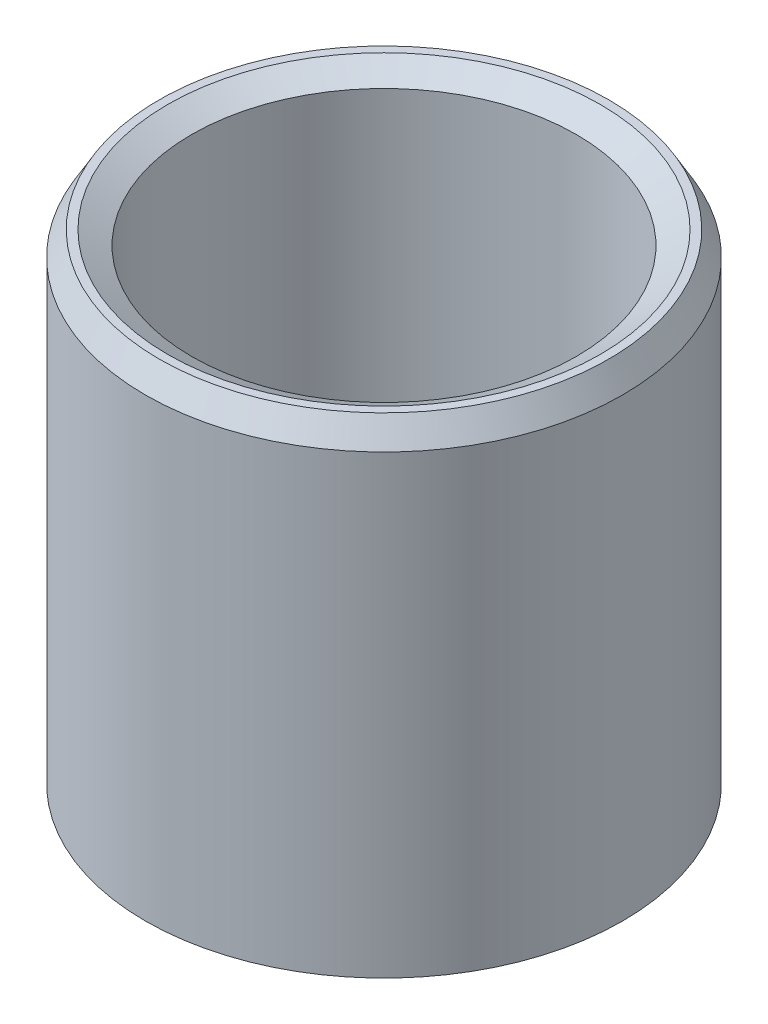
ISO-10303-21;
HEADER;
FILE_DESCRIPTION(('STEP AP214'),'2;1');
FILE_NAME('part.step','',(''),(''),'','','');
FILE_SCHEMA(('AUTOMOTIVE_DESIGN { 1 0 10303 214 1 1 1 1 }'));
ENDSEC;
DATA;
#1=APPLICATION_CONTEXT('core data for automotive mechanical design processes');
#2=APPLICATION_PROTOCOL_DEFINITION('international standard','automotive_design',2000,#1);
#3=PRODUCT_CONTEXT('',#1,'mechanical');
#4=PRODUCT('Part','Part','',(#3));
#5=PRODUCT_RELATED_PRODUCT_CATEGORY('part','',(#4));
#6=PRODUCT_DEFINITION_FORMATION('','',#4);
#7=PRODUCT_DEFINITION_CONTEXT('part definition',#1,'design');
#8=PRODUCT_DEFINITION('design','',#6,#7);
#9=PRODUCT_DEFINITION_SHAPE('','',#8);
#10=(LENGTH_UNIT() NAMED_UNIT(*) SI_UNIT(.MILLI.,.METRE.));
#11=(NAMED_UNIT(*) PLANE_ANGLE_UNIT() SI_UNIT($,.RADIAN.));
#12=(NAMED_UNIT(*) SI_UNIT($,.STERADIAN.) SOLID_ANGLE_UNIT());
#13=UNCERTAINTY_MEASURE_WITH_UNIT(LENGTH_MEASURE(1.E-05),#10,'distance_accuracy_value','');
#14=(GEOMETRIC_REPRESENTATION_CONTEXT(3) GLOBAL_UNCERTAINTY_ASSIGNED_CONTEXT((#13)) GLOBAL_UNIT_ASSIGNED_CONTEXT((#10,
#11,#12)) REPRESENTATION_CONTEXT('',''));
#15=CARTESIAN_POINT('',(0.,0.,0.));
#16=DIRECTION('',(0.,0.,1.));
#17=DIRECTION('',(1.,0.,0.));
#18=AXIS2_PLACEMENT_3D('',#15,#16,#17);
#19=CARTESIAN_POINT('',(0.,72.4037034573825,0.));
#20=DIRECTION('',(0.,-1.,0.));
#21=DIRECTION('',(0.,0.,-1.));
#22=AXIS2_PLACEMENT_3D('',#19,#20,#21);
#23=CYLINDRICAL_SURFACE('',#22,35.);
#24=CARTESIAN_POINT('',(0.,2.03994487551047,0.));
#25=DIRECTION('',(0.,1.,0.));
#26=DIRECTION('',(0.,0.,1.));
#27=AXIS2_PLACEMENT_3D('',#24,#25,#26);
#28=CIRCLE('',#27,35.);
#29=CARTESIAN_POINT('',(0.,2.03994487551047,35.));
#30=VERTEX_POINT('',#29);
#31=EDGE_CURVE('E10',#30,#30,#28,.T.);
#32=ORIENTED_EDGE('',*,*,#31,.T.);
#33=EDGE_LOOP('',(#32));
#34=FACE_BOUND('',#33,.T.);
#35=CARTESIAN_POINT('',(0.,68.8704152883586,0.));
#36=DIRECTION('',(0.,1.,0.));
#37=DIRECTION('',(0.,0.,1.));
#38=AXIS2_PLACEMENT_3D('',#35,#36,#37);
#39=CIRCLE('',#38,35.);
#40=CARTESIAN_POINT('',(0.,68.8704152883586,35.));
#41=VERTEX_POINT('',#40);
#42=EDGE_CURVE('E50',#41,#41,#39,.F.);
#43=ORIENTED_EDGE('',*,*,#42,.T.);
#44=EDGE_LOOP('',(#43));
#45=FACE_BOUND('',#44,.T.);
#46=ADVANCED_FACE('F39',(#34,#45),#23,.T.);
#47=CARTESIAN_POINT('',(0.,72.4037034573825,0.));
#48=DIRECTION('',(0.,1.,0.));
#49=DIRECTION('',(0.,0.,1.));
#50=AXIS2_PLACEMENT_3D('',#47,#48,#49);
#51=PLANE('',#50);
#52=CARTESIAN_POINT('',(0.,72.4037034573825,0.));
#53=DIRECTION('',(0.,1.,0.));
#54=DIRECTION('',(0.,0.,1.));
#55=AXIS2_PLACEMENT_3D('',#52,#53,#54);
#56=CIRCLE('',#55,31.7445914145654);
#57=CARTESIAN_POINT('',(0.,72.4037034573825,31.7445914145654));
#58=VERTEX_POINT('',#57);
#59=EDGE_CURVE('E58',#58,#58,#56,.F.);
#60=ORIENTED_EDGE('',*,*,#59,.T.);
#61=EDGE_LOOP('',(#60));
#62=FACE_BOUND('',#61,.T.);
#63=CARTESIAN_POINT('',(0.,72.4037034573825,0.));
#64=DIRECTION('',(0.,1.,0.));
#65=DIRECTION('',(0.,0.,1.));
#66=AXIS2_PLACEMENT_3D('',#63,#64,#65);
#67=CIRCLE('',#66,32.9600551244895);
#68=CARTESIAN_POINT('',(0.,72.4037034573825,32.9600551244895));
#69=VERTEX_POINT('',#68);
#70=EDGE_CURVE('E61',#69,#69,#67,.T.);
#71=ORIENTED_EDGE('',*,*,#70,.T.);
#72=EDGE_LOOP('',(#71));
#73=FACE_BOUND('',#72,.T.);
#74=ADVANCED_FACE('F88',(#62,#73),#51,.T.);
#75=CARTESIAN_POINT('',(0.,0.,0.));
#76=DIRECTION('',(0.,1.,0.));
#77=DIRECTION('',(0.,0.,1.));
#78=AXIS2_PLACEMENT_3D('',#75,#76,#77);
#79=PLANE('',#78);
#80=CARTESIAN_POINT('',(0.,0.,0.));
#81=DIRECTION('',(0.,1.,0.));
#82=DIRECTION('',(0.,0.,1.));
#83=AXIS2_PLACEMENT_3D('',#80,#81,#82);
#84=CIRCLE('',#83,30.251248121052);
#85=CARTESIAN_POINT('',(0.,0.,30.251248121052));
#86=VERTEX_POINT('',#85);
#87=EDGE_CURVE('E51',#86,#86,#84,.T.);
#88=ORIENTED_EDGE('',*,*,#87,.T.);
#89=EDGE_LOOP('',(#88));
#90=FACE_BOUND('',#89,.T.);
#91=CARTESIAN_POINT('',(0.,0.,0.));
#92=DIRECTION('',(0.,1.,0.));
#93=DIRECTION('',(0.,0.,1.));
#94=AXIS2_PLACEMENT_3D('',#91,#92,#93);
#95=CIRCLE('',#94,31.4667118309761);
#96=CARTESIAN_POINT('',(0.,0.,31.4667118309761));
#97=VERTEX_POINT('',#96);
#98=EDGE_CURVE('E54',#97,#97,#95,.F.);
#99=ORIENTED_EDGE('',*,*,#98,.T.);
#100=EDGE_LOOP('',(#99));
#101=FACE_BOUND('',#100,.T.);
#102=ADVANCED_FACE('F83',(#90,#101),#79,.F.);
#103=CARTESIAN_POINT('',(0.,72.4037034573825,0.));
#104=DIRECTION('',(0.,-1.,0.));
#105=DIRECTION('',(0.,0.,-1.));
#106=AXIS2_PLACEMENT_3D('',#103,#104,#105);
#107=CYLINDRICAL_SURFACE('',#106,28.2113032455415);
#108=CARTESIAN_POINT('',(0.,70.3637585818721,0.));
#109=DIRECTION('',(0.,1.,0.));
#110=DIRECTION('',(0.,0.,1.));
#111=AXIS2_PLACEMENT_3D('',#108,#109,#110);
#112=CIRCLE('',#111,28.2113032455415);
#113=CARTESIAN_POINT('',(0.,70.3637585818721,28.2113032455415));
#114=VERTEX_POINT('',#113);
#115=EDGE_CURVE('E67',#114,#114,#112,.T.);
#116=ORIENTED_EDGE('',*,*,#115,.T.);
#117=EDGE_LOOP('',(#116));
#118=FACE_BOUND('',#117,.T.);
#119=CARTESIAN_POINT('',(0.,3.53328816902396,0.));
#120=DIRECTION('',(0.,1.,0.));
#121=DIRECTION('',(0.,0.,1.));
#122=AXIS2_PLACEMENT_3D('',#119,#120,#121);
#123=CIRCLE('',#122,28.2113032455415);
#124=CARTESIAN_POINT('',(0.,3.53328816902396,28.2113032455415));
#125=VERTEX_POINT('',#124);
#126=EDGE_CURVE('E69',#125,#125,#123,.F.);
#127=ORIENTED_EDGE('',*,*,#126,.T.);
#128=EDGE_LOOP('',(#127));
#129=FACE_BOUND('',#128,.T.);
#130=ADVANCED_FACE('F71',(#118,#129),#107,.F.);
#131=CARTESIAN_POINT('',(0.,70.3637585818721,0.));
#132=DIRECTION('',(0.,1.,0.));
#133=DIRECTION('',(0.,0.,1.));
#134=AXIS2_PLACEMENT_3D('',#131,#132,#133);
#135=CONICAL_SURFACE('',#134,28.2113032455415,1.0471975511966);
#136=ORIENTED_EDGE('',*,*,#59,.F.);
#137=EDGE_LOOP('',(#136));
#138=FACE_BOUND('',#137,.T.);
#139=ORIENTED_EDGE('',*,*,#115,.F.);
#140=EDGE_LOOP('',(#139));
#141=FACE_BOUND('',#140,.T.);
#142=ADVANCED_FACE('F77',(#138,#141),#135,.F.);
#143=CARTESIAN_POINT('',(0.,0.,0.));
#144=DIRECTION('',(0.,-1.,0.));
#145=DIRECTION('',(0.,0.,-1.));
#146=AXIS2_PLACEMENT_3D('',#143,#144,#145);
#147=CONICAL_SURFACE('',#146,30.251248121052,0.523598775598294);
#148=ORIENTED_EDGE('',*,*,#126,.F.);
#149=EDGE_LOOP('',(#148));
#150=FACE_BOUND('',#149,.T.);
#151=ORIENTED_EDGE('',*,*,#87,.F.);
#152=EDGE_LOOP('',(#151));
#153=FACE_BOUND('',#152,.T.);
#154=ADVANCED_FACE('F73',(#150,#153),#147,.F.);
#155=CARTESIAN_POINT('',(0.,2.03994487551047,0.));
#156=DIRECTION('',(0.,1.,0.));
#157=DIRECTION('',(0.,0.,1.));
#158=AXIS2_PLACEMENT_3D('',#155,#156,#157);
#159=CONICAL_SURFACE('',#158,35.,1.0471975511966);
#160=CARTESIAN_POINT('',(0.,0.,31.4667118309761));
#161=CARTESIAN_POINT('',(0.,0.0212494257865677,31.5035169160701));
#162=CARTESIAN_POINT('',(0.,0.0424988515731348,31.5403220011641));
#163=CARTESIAN_POINT('',(0.,0.0849977031462688,31.6139321713521));
#164=CARTESIAN_POINT('',(0.,0.106247128932836,31.6507372564461));
#165=CARTESIAN_POINT('',(0.,0.148745980505971,31.7243474266341));
#166=CARTESIAN_POINT('',(0.,0.169995406292539,31.7611525117281));
#167=CARTESIAN_POINT('',(0.,0.212494257865674,31.8347626819161));
#168=CARTESIAN_POINT('',(0.,0.233743683652241,31.87156776701));
#169=CARTESIAN_POINT('',(0.,0.276242535225376,31.9451779371981));
#170=CARTESIAN_POINT('',(0.,0.297491961011943,31.981983022292));
#171=CARTESIAN_POINT('',(0.,0.339990812585078,32.0555931924801));
#172=CARTESIAN_POINT('',(0.,0.361240238371646,32.092398277574));
#173=CARTESIAN_POINT('',(0.,0.40373908994478,32.1660084477621));
#174=CARTESIAN_POINT('',(0.,0.424988515731348,32.202813532856));
#175=CARTESIAN_POINT('',(0.,0.467487367304483,32.2764237030441));
#176=CARTESIAN_POINT('',(0.,0.48873679309105,32.313228788138));
#177=CARTESIAN_POINT('',(0.,0.531235644664185,32.3868389583261));
#178=CARTESIAN_POINT('',(0.,0.552485070450752,32.42364404342));
#179=CARTESIAN_POINT('',(0.,0.594983922023887,32.497254213608));
#180=CARTESIAN_POINT('',(0.,0.616233347810455,32.534059298702));
#181=CARTESIAN_POINT('',(0.,0.65873219938359,32.60766946889));
#182=CARTESIAN_POINT('',(0.,0.679981625170157,32.644474553984));
#183=CARTESIAN_POINT('',(0.,0.722480476743292,32.718084724172));
#184=CARTESIAN_POINT('',(0.,0.743729902529859,32.754889809266));
#185=CARTESIAN_POINT('',(0.,0.786228754102994,32.828499979454));
#186=CARTESIAN_POINT('',(0.,0.807478179889561,32.865305064548));
#187=CARTESIAN_POINT('',(0.,0.849977031462696,32.938915234736));
#188=CARTESIAN_POINT('',(0.,0.871226457249264,32.97572031983));
#189=CARTESIAN_POINT('',(0.,0.913725308822398,33.049330490018));
#190=CARTESIAN_POINT('',(0.,0.934974734608965,33.086135575112));
#191=CARTESIAN_POINT('',(0.,0.9774735861821,33.1597457453));
#192=CARTESIAN_POINT('',(0.,0.998723011968669,33.196550830394));
#193=CARTESIAN_POINT('',(0.,1.0412218635418,33.270161000582));
#194=CARTESIAN_POINT('',(0.,1.06247128932837,33.306966085676));
#195=CARTESIAN_POINT('',(0.,1.1049701409015,33.380576255864));
#196=CARTESIAN_POINT('',(0.,1.12621956668807,33.417381340958));
#197=CARTESIAN_POINT('',(0.,1.16871841826121,33.490991511146));
#198=CARTESIAN_POINT('',(0.,1.18996784404777,33.52779659624));
#199=CARTESIAN_POINT('',(0.,1.23246669562091,33.601406766428));
#200=CARTESIAN_POINT('',(0.,1.25371612140748,33.638211851522));
#201=CARTESIAN_POINT('',(0.,1.29621497298061,33.71182202171));
#202=CARTESIAN_POINT('',(0.,1.31746439876718,33.748627106804));
#203=CARTESIAN_POINT('',(0.,1.35996325034031,33.822237276992));
#204=CARTESIAN_POINT('',(0.,1.38121267612688,33.859042362086));
#205=CARTESIAN_POINT('',(0.,1.42371152770002,33.932652532274));
#206=CARTESIAN_POINT('',(0.,1.44496095348658,33.969457617368));
#207=CARTESIAN_POINT('',(0.,1.48745980505972,34.043067787556));
#208=CARTESIAN_POINT('',(0.,1.50870923084629,34.07987287265));
#209=CARTESIAN_POINT('',(0.,1.55120808241942,34.153483042838));
#210=CARTESIAN_POINT('',(0.,1.57245750820599,34.190288127932));
#211=CARTESIAN_POINT('',(0.,1.61495635977912,34.26389829812));
#212=CARTESIAN_POINT('',(0.,1.63620578556569,34.300703383214));
#213=CARTESIAN_POINT('',(0.,1.67870463713883,34.374313553402));
#214=CARTESIAN_POINT('',(0.,1.69995406292539,34.411118638496));
#215=CARTESIAN_POINT('',(0.,1.74245291449853,34.484728808684));
#216=CARTESIAN_POINT('',(0.,1.76370234028509,34.521533893778));
#217=CARTESIAN_POINT('',(0.,1.80620119185823,34.595144063966));
#218=CARTESIAN_POINT('',(0.,1.8274506176448,34.63194914906));
#219=CARTESIAN_POINT('',(0.,1.86994946921793,34.705559319248));
#220=CARTESIAN_POINT('',(0.,1.8911988950045,34.742364404342));
#221=CARTESIAN_POINT('',(0.,1.93369774657763,34.81597457453));
#222=CARTESIAN_POINT('',(0.,1.9549471723642,34.852779659624));
#223=CARTESIAN_POINT('',(0.,1.99744602393734,34.926389829812));
#224=CARTESIAN_POINT('',(0.,2.0186954497239,34.963194914906));
#225=CARTESIAN_POINT('',(0.,2.03994487551047,35.));
#226=B_SPLINE_CURVE_WITH_KNOTS('',3,(#160,#161,#162,#163,#164,#165,#166,#167,#168,#169,#170,
#171,#172,#173,#174,#175,#176,#177,#178,#179,#180,#181,#182,#183,#184,#185,#186,#187,#188,#189,
#190,#191,#192,#193,#194,#195,#196,#197,#198,#199,#200,#201,#202,#203,#204,#205,#206,#207,#208,
#209,#210,#211,#212,#213,#214,#215,#216,#217,#218,#219,#220,#221,#222,#223,#224,#225),
.UNSPECIFIED.,.F.,.F.,(4,2,2,2,2,2,2,2,2,2,2,2,2,2,2,2,2,2,2,2,2,2,2,2,2,2,2,2,2,2,2,2,4),(0.,
0.127496554719407,0.254993109438813,0.382489664158214,0.509986218877621,0.637482773597027,
0.764979328316434,0.89247588303584,1.01997243775525,1.14746899247465,1.27496554719405,
1.40246210191346,1.52995865663287,1.65745521135227,1.78495176607168,1.91244832079109,
2.03994487551049,2.16744143022989,2.2949379849493,2.42243453966871,2.54993109438811,
2.67742764910752,2.80492420382693,2.93242075854633,3.05991731326574,3.18741386798514,
3.31491042270455,3.44240697742396,3.56990353214336,3.69740008686276,3.82489664158217,
3.95239319630158,4.07988975102098),.UNSPECIFIED.);
#227=EDGE_CURVE('BSEAM76',#97,#30,#226,.T.);
#228=ORIENTED_EDGE('',*,*,#98,.F.);
#229=ORIENTED_EDGE('',*,*,#31,.F.);
#230=ORIENTED_EDGE('',*,*,#227,.T.);
#231=ORIENTED_EDGE('',*,*,#227,.F.);
#232=EDGE_LOOP('',(#228,#230,#229,#231));
#233=FACE_BOUND('',#232,.T.);
#234=ADVANCED_FACE('F76',(#233),#159,.T.);
#235=CARTESIAN_POINT('',(0.,72.4037034573825,0.));
#236=DIRECTION('',(0.,-1.,0.));
#237=DIRECTION('',(0.,0.,-1.));
#238=AXIS2_PLACEMENT_3D('',#235,#236,#237);
#239=CONICAL_SURFACE('',#238,32.9600551244895,0.523598775598296);
#240=ORIENTED_EDGE('',*,*,#42,.F.);
#241=EDGE_LOOP('',(#240));
#242=FACE_BOUND('',#241,.T.);
#243=ORIENTED_EDGE('',*,*,#70,.F.);
#244=EDGE_LOOP('',(#243));
#245=FACE_BOUND('',#244,.T.);
#246=ADVANCED_FACE('F45',(#242,#245),#239,.T.);
#247=CLOSED_SHELL('',(#46,#74,#102,#130,#142,#154,#234,#246));
#248=MANIFOLD_SOLID_BREP('B2',#247);
#249=ADVANCED_BREP_SHAPE_REPRESENTATION('',(#18,#248),#14);
#250=SHAPE_DEFINITION_REPRESENTATION(#9,#249);
ENDSEC;
END-ISO-10303-21;
